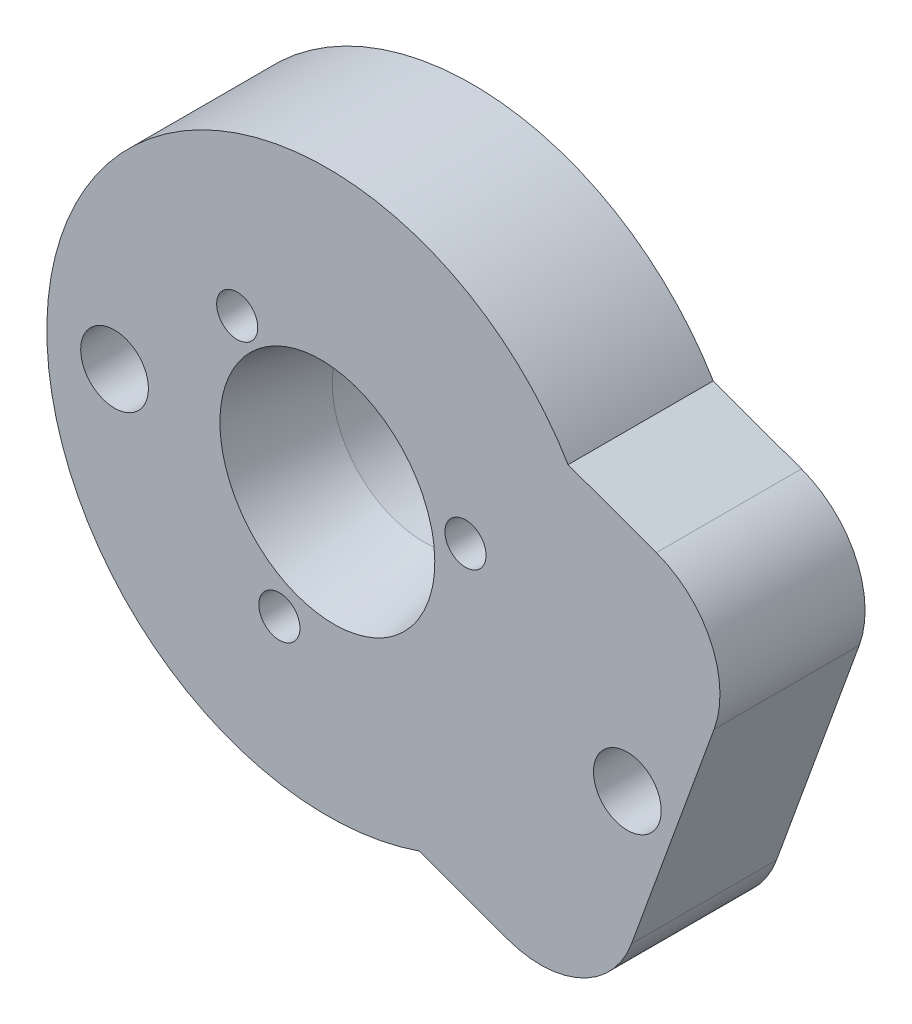
ISO-10303-21;
HEADER;
FILE_DESCRIPTION(('STEP AP214'),'2;1');
FILE_NAME('part.step','',(''),(''),'','','');
FILE_SCHEMA(('AUTOMOTIVE_DESIGN { 1 0 10303 214 1 1 1 1 }'));
ENDSEC;
DATA;
#1=APPLICATION_CONTEXT('core data for automotive mechanical design processes');
#2=APPLICATION_PROTOCOL_DEFINITION('international standard','automotive_design',2000,#1);
#3=PRODUCT_CONTEXT('',#1,'mechanical');
#4=PRODUCT('Part','Part','',(#3));
#5=PRODUCT_RELATED_PRODUCT_CATEGORY('part','',(#4));
#6=PRODUCT_DEFINITION_FORMATION('','',#4);
#7=PRODUCT_DEFINITION_CONTEXT('part definition',#1,'design');
#8=PRODUCT_DEFINITION('design','',#6,#7);
#9=PRODUCT_DEFINITION_SHAPE('','',#8);
#10=(LENGTH_UNIT() NAMED_UNIT(*) SI_UNIT(.MILLI.,.METRE.));
#11=(NAMED_UNIT(*) PLANE_ANGLE_UNIT() SI_UNIT($,.RADIAN.));
#12=(NAMED_UNIT(*) SI_UNIT($,.STERADIAN.) SOLID_ANGLE_UNIT());
#13=UNCERTAINTY_MEASURE_WITH_UNIT(LENGTH_MEASURE(1.E-05),#10,'distance_accuracy_value','');
#14=(GEOMETRIC_REPRESENTATION_CONTEXT(3) GLOBAL_UNCERTAINTY_ASSIGNED_CONTEXT((#13)) GLOBAL_UNIT_ASSIGNED_CONTEXT((#10,
#11,#12)) REPRESENTATION_CONTEXT('',''));
#15=CARTESIAN_POINT('',(0.,0.,0.));
#16=DIRECTION('',(0.,0.,1.));
#17=DIRECTION('',(1.,0.,0.));
#18=AXIS2_PLACEMENT_3D('',#15,#16,#17);
#19=CARTESIAN_POINT('',(0.,0.,10.));
#20=DIRECTION('',(0.,0.,-1.));
#21=DIRECTION('',(-1.,0.,0.));
#22=AXIS2_PLACEMENT_3D('',#19,#20,#21);
#23=CYLINDRICAL_SURFACE('',#22,29.);
#24=CARTESIAN_POINT('',(0.,0.,-5.));
#25=DIRECTION('',(0.,0.,1.));
#26=DIRECTION('',(1.,0.,0.));
#27=AXIS2_PLACEMENT_3D('',#24,#25,#26);
#28=CIRCLE('',#27,29.);
#29=CARTESIAN_POINT('',(24.88823335682,14.8854237553544,-5.));
#30=VERTEX_POINT('',#29);
#31=CARTESIAN_POINT('',(9.49732690716521,-27.4007441800115,-5.));
#32=VERTEX_POINT('',#31);
#33=EDGE_CURVE('E272',#30,#32,#28,.T.);
#34=ORIENTED_EDGE('',*,*,#33,.T.);
#35=DIRECTION('',(0.,0.,-1.));
#36=VECTOR('',#35,1.);
#37=CARTESIAN_POINT('',(9.4973269071652,-27.4007441800115,10.));
#38=LINE('',#37,#36);
#39=CARTESIAN_POINT('',(9.49732690716521,-27.4007441800115,10.));
#40=VERTEX_POINT('',#39);
#41=EDGE_CURVE('E164',#32,#40,#38,.F.);
#42=ORIENTED_EDGE('',*,*,#41,.T.);
#43=CARTESIAN_POINT('',(0.,0.,10.));
#44=DIRECTION('',(0.,0.,1.));
#45=DIRECTION('',(1.,0.,0.));
#46=AXIS2_PLACEMENT_3D('',#43,#44,#45);
#47=CIRCLE('',#46,29.);
#48=CARTESIAN_POINT('',(24.88823335682,14.8854237553544,10.));
#49=VERTEX_POINT('',#48);
#50=EDGE_CURVE('E13',#49,#40,#47,.T.);
#51=ORIENTED_EDGE('',*,*,#50,.F.);
#52=DIRECTION('',(0.,0.,-1.));
#53=VECTOR('',#52,1.);
#54=CARTESIAN_POINT('',(24.88823335682,14.8854237553544,10.));
#55=LINE('',#54,#53);
#56=EDGE_CURVE('E239',#30,#49,#55,.F.);
#57=ORIENTED_EDGE('',*,*,#56,.F.);
#58=EDGE_LOOP('',(#34,#42,#51,#57));
#59=FACE_BOUND('',#58,.T.);
#60=ADVANCED_FACE('F140',(#59),#23,.T.);
#61=CARTESIAN_POINT('',(0.,0.,10.));
#62=DIRECTION('',(0.,0.,1.));
#63=DIRECTION('',(1.,0.,0.));
#64=AXIS2_PLACEMENT_3D('',#61,#62,#63);
#65=PLANE('',#64);
#66=CARTESIAN_POINT('',(-22.,0.,10.));
#67=DIRECTION('',(0.,0.,1.));
#68=DIRECTION('',(1.,0.,0.));
#69=AXIS2_PLACEMENT_3D('',#66,#67,#68);
#70=CIRCLE('',#69,3.5);
#71=CARTESIAN_POINT('',(-18.5,0.,10.));
#72=VERTEX_POINT('',#71);
#73=EDGE_CURVE('E224',#72,#72,#70,.T.);
#74=ORIENTED_EDGE('',*,*,#73,.F.);
#75=EDGE_LOOP('',(#74));
#76=FACE_BOUND('',#75,.T.);
#77=ORIENTED_EDGE('',*,*,#50,.T.);
#78=DIRECTION('',(-0.939692620785911,0.342020143325662,0.));
#79=VECTOR('',#78,1.);
#80=CARTESIAN_POINT('',(18.6159401571781,-30.7196479808015,10.));
#81=LINE('',#80,#79);
#82=CARTESIAN_POINT('',(18.6159401571781,-30.7196479808015,10.));
#83=VERTEX_POINT('',#82);
#84=EDGE_CURVE('E240',#83,#40,#81,.T.);
#85=ORIENTED_EDGE('',*,*,#84,.F.);
#86=CARTESIAN_POINT('',(22.0361415904347,-21.3227217729424,10.));
#87=DIRECTION('',(0.,0.,1.));
#88=DIRECTION('',(1.,0.,0.));
#89=AXIS2_PLACEMENT_3D('',#86,#87,#88);
#90=CIRCLE('',#89,9.99999999999999);
#91=CARTESIAN_POINT('',(31.4330677982938,-24.7429232061991,10.));
#92=VERTEX_POINT('',#91);
#93=EDGE_CURVE('E202',#92,#83,#90,.F.);
#94=ORIENTED_EDGE('',*,*,#93,.F.);
#95=DIRECTION('',(0.342020143325663,0.93969262078591,0.));
#96=VECTOR('',#95,1.);
#97=CARTESIAN_POINT('',(31.4330677982938,-24.7429232061991,10.));
#98=LINE('',#97,#96);
#99=CARTESIAN_POINT('',(39.9835713814354,-1.25060768655132,10.));
#100=VERTEX_POINT('',#99);
#101=EDGE_CURVE('E218',#92,#100,#98,.T.);
#102=ORIENTED_EDGE('',*,*,#101,.T.);
#103=CARTESIAN_POINT('',(30.5866451735763,2.16959374670531,10.));
#104=DIRECTION('',(0.,0.,1.));
#105=DIRECTION('',(1.,0.,0.));
#106=AXIS2_PLACEMENT_3D('',#103,#104,#105);
#107=CIRCLE('',#106,10.);
#108=CARTESIAN_POINT('',(34.0068466068329,11.5665199545644,10.));
#109=VERTEX_POINT('',#108);
#110=EDGE_CURVE('E220',#100,#109,#107,.T.);
#111=ORIENTED_EDGE('',*,*,#110,.T.);
#112=DIRECTION('',(-0.93969262078591,0.342020143325664,0.));
#113=VECTOR('',#112,1.);
#114=CARTESIAN_POINT('',(34.0068466068329,11.5665199545644,10.));
#115=LINE('',#114,#113);
#116=EDGE_CURVE('E156',#109,#49,#115,.T.);
#117=ORIENTED_EDGE('',*,*,#116,.T.);
#118=EDGE_LOOP('',(#77,#85,#94,#102,#111,#117));
#119=FACE_BOUND('',#118,.T.);
#120=CARTESIAN_POINT('',(0.,0.,10.));
#121=DIRECTION('',(0.,0.,1.));
#122=DIRECTION('',(0.500000000000004,-0.866025403784436,0.));
#123=AXIS2_PLACEMENT_3D('',#120,#121,#122);
#124=ELLIPSE('',#123,11.7,10.9);
#125=CARTESIAN_POINT('',(5.85000000000005,-10.1324972242779,10.));
#126=VERTEX_POINT('',#125);
#127=EDGE_CURVE('E149',#126,#126,#124,.T.);
#128=ORIENTED_EDGE('',*,*,#127,.F.);
#129=EDGE_LOOP('',(#128));
#130=FACE_BOUND('',#129,.T.);
#131=CARTESIAN_POINT('',(-4.95929207822124,-13.6255430013952,10.));
#132=DIRECTION('',(0.,0.,1.));
#133=DIRECTION('',(1.,0.,0.));
#134=AXIS2_PLACEMENT_3D('',#131,#132,#133);
#135=CIRCLE('',#134,2.125);
#136=CARTESIAN_POINT('',(-2.83429207822124,-13.6255430013952,10.));
#137=VERTEX_POINT('',#136);
#138=EDGE_CURVE('E254',#137,#137,#135,.T.);
#139=ORIENTED_EDGE('',*,*,#138,.F.);
#140=EDGE_LOOP('',(#139));
#141=FACE_BOUND('',#140,.T.);
#142=CARTESIAN_POINT('',(14.279712418677,2.51789857617159,10.));
#143=DIRECTION('',(0.,0.,1.));
#144=DIRECTION('',(1.,0.,0.));
#145=AXIS2_PLACEMENT_3D('',#142,#143,#144);
#146=CIRCLE('',#145,2.125);
#147=CARTESIAN_POINT('',(16.404712418677,2.51789857617159,10.));
#148=VERTEX_POINT('',#147);
#149=EDGE_CURVE('E262',#148,#148,#146,.T.);
#150=ORIENTED_EDGE('',*,*,#149,.F.);
#151=EDGE_LOOP('',(#150));
#152=FACE_BOUND('',#151,.T.);
#153=CARTESIAN_POINT('',(-9.32042034045485,11.1076444252252,10.));
#154=DIRECTION('',(0.,0.,1.));
#155=DIRECTION('',(1.,0.,0.));
#156=AXIS2_PLACEMENT_3D('',#153,#154,#155);
#157=CIRCLE('',#156,2.125);
#158=CARTESIAN_POINT('',(-7.19542034045485,11.1076444252252,10.));
#159=VERTEX_POINT('',#158);
#160=EDGE_CURVE('E265',#159,#159,#157,.T.);
#161=ORIENTED_EDGE('',*,*,#160,.F.);
#162=EDGE_LOOP('',(#161));
#163=FACE_BOUND('',#162,.T.);
#164=CARTESIAN_POINT('',(31.009856485935,-11.2866647297469,10.));
#165=DIRECTION('',(0.,0.,1.));
#166=DIRECTION('',(1.,0.,0.));
#167=AXIS2_PLACEMENT_3D('',#164,#165,#166);
#168=CIRCLE('',#167,3.5);
#169=CARTESIAN_POINT('',(34.509856485935,-11.2866647297469,10.));
#170=VERTEX_POINT('',#169);
#171=EDGE_CURVE('E236',#170,#170,#168,.F.);
#172=ORIENTED_EDGE('',*,*,#171,.T.);
#173=EDGE_LOOP('',(#172));
#174=FACE_BOUND('',#173,.T.);
#175=ADVANCED_FACE('F313',(#76,#119,#130,#141,#152,#163,#174),#65,.T.);
#176=CARTESIAN_POINT('',(-8.2272413359522,-4.74999999999995,0.));
#177=CARTESIAN_POINT('',(-8.42931393016856,-4.86666666666662,1.66666666666667));
#178=CARTESIAN_POINT('',(-8.83345911860129,-5.09999999999996,5.));
#179=CARTESIAN_POINT('',(-9.237604307034,-5.33333333333335,8.33333333333333));
#180=CARTESIAN_POINT('',(-9.43967690125036,-5.45000000000005,10.));
#181=CARTESIAN_POINT('',(-7.60546779489093,-5.8269433639201,0.));
#182=CARTESIAN_POINT('',(-7.78706689015017,-5.97907117098922,1.66666666666667));
#183=CARTESIAN_POINT('',(-8.15026508066864,-6.28332678512747,5.));
#184=CARTESIAN_POINT('',(-8.51666298543088,-6.58204033162581,8.33333333333333));
#185=CARTESIAN_POINT('',(-8.699861937812,-6.73139710487497,10.));
#186=CARTESIAN_POINT('',(-5.93428765157635,-7.73339621782849,0.));
#187=CARTESIAN_POINT('',(-6.07184627964156,-7.95489124411117,1.66666666666666));
#188=CARTESIAN_POINT('',(-6.34696353577197,-8.39788129667655,5.));
#189=CARTESIAN_POINT('',(-6.62560368094945,-8.82043661085555,8.33333333333334));
#190=CARTESIAN_POINT('',(-6.76492375353818,-9.03171426794505,10.));
#191=CARTESIAN_POINT('',(-2.52271263730693,-9.41546349724764,0.));
#192=CARTESIAN_POINT('',(-2.57075740713248,-9.73346941615548,1.66666666666667));
#193=CARTESIAN_POINT('',(-2.66684694678358,-10.3694812539712,5.00000000000001));
#194=CARTESIAN_POINT('',(-2.77030559858351,-10.9465261862933,8.33333333333333));
#195=CARTESIAN_POINT('',(-2.82203492448348,-11.2350486524544,9.99999999999999));
#196=CARTESIAN_POINT('',(1.27227334912264,-9.66428554733693,0.));
#197=CARTESIAN_POINT('',(1.34693140463563,-10.0387457867895,1.66666666666666));
#198=CARTESIAN_POINT('',(1.49624751566162,-10.7876662656946,5.));
#199=CARTESIAN_POINT('',(1.61681931529875,-11.4482412450606,8.33333333333333));
#200=CARTESIAN_POINT('',(1.67710521511731,-11.7785287347436,9.99999999999999));
#201=CARTESIAN_POINT('',(4.8738319958937,-8.44172464444286,0.));
#202=CARTESIAN_POINT('',(5.07724941175743,-8.79405394386322,1.66666666666667));
#203=CARTESIAN_POINT('',(5.48408424348489,-9.49871254270392,5.00000000000002));
#204=CARTESIAN_POINT('',(5.83864101663948,-10.1128228879752,8.33333333333335));
#205=CARTESIAN_POINT('',(6.01591940321678,-10.4198780606109,10.));
#206=CARTESIAN_POINT('',(7.73338011885922,-5.93396381456668,0.));
#207=CARTESIAN_POINT('',(8.02034317117585,-6.18584970696435,1.66666666666666));
#208=CARTESIAN_POINT('',(8.59426927580909,-6.68962149175969,4.99999999999998));
#209=CARTESIAN_POINT('',(9.10605808922591,-7.12432722290843,8.33333333333333));
#210=CARTESIAN_POINT('',(9.36195249593433,-7.34168008848279,10.));
#211=CARTESIAN_POINT('',(9.41538689567493,-2.52299851826811,0.));
#212=CARTESIAN_POINT('',(9.71481048491571,-2.64039348653412,1.66666666666667));
#213=CARTESIAN_POINT('',(10.3136576633973,-2.87518342306615,5.00000000000003));
#214=CARTESIAN_POINT('',(10.8651225598133,-3.07410806852712,8.33333333333334));
#215=CARTESIAN_POINT('',(11.1408550080214,-3.17357039125761,10.));
#216=CARTESIAN_POINT('',(9.66446140795818,1.27254575071504,0.));
#217=CARTESIAN_POINT('',(9.92506104156348,1.28092750398791,1.66666666666666));
#218=CARTESIAN_POINT('',(10.4462603087741,1.29769101053365,4.99999999999998));
#219=CARTESIAN_POINT('',(10.951524017946,1.32772279768209,8.33333333333333));
#220=CARTESIAN_POINT('',(11.2041558725319,1.34273869125631,10.));
#221=CARTESIAN_POINT('',(8.84901487701347,3.6730566360798,0.));
#222=CARTESIAN_POINT('',(9.07156097018697,3.75426216234402,1.66666666666667));
#223=CARTESIAN_POINT('',(9.51665315653395,3.91667321487245,5.));
#224=CARTESIAN_POINT('',(9.95854562863716,4.08462633504082,8.33333333333333));
#225=CARTESIAN_POINT('',(10.1794918646888,4.16860289512501,10.));
#226=CARTESIAN_POINT('',(7.60546779489093,5.8269433639201,0.));
#227=CARTESIAN_POINT('',(7.78706689015017,5.97907117098922,1.66666666666667));
#228=CARTESIAN_POINT('',(8.15026508066865,6.28332678512746,5.));
#229=CARTESIAN_POINT('',(8.51666298543093,6.58204033162574,8.33333333333333));
#230=CARTESIAN_POINT('',(8.69986193781207,6.73139710487488,10.));
#231=CARTESIAN_POINT('',(5.93428765157634,7.73339621782852,0.));
#232=CARTESIAN_POINT('',(6.07184627964155,7.95489124411119,1.66666666666667));
#233=CARTESIAN_POINT('',(6.34696353577197,8.39788129667652,5.));
#234=CARTESIAN_POINT('',(6.62560368094951,8.82043661085551,8.33333333333334));
#235=CARTESIAN_POINT('',(6.76492375353827,9.031714267945,10.));
#236=CARTESIAN_POINT('',(2.52271263730692,9.41546349724761,0.));
#237=CARTESIAN_POINT('',(2.57075740713246,9.73346941615547,1.66666666666667));
#238=CARTESIAN_POINT('',(2.66684694678356,10.3694812539712,5.00000000000001));
#239=CARTESIAN_POINT('',(2.77030559858355,10.9465261862933,8.33333333333332));
#240=CARTESIAN_POINT('',(2.82203492448355,11.2350486524544,9.99999999999998));
#241=CARTESIAN_POINT('',(-1.27227334912264,9.66428554733697,0.));
#242=CARTESIAN_POINT('',(-1.34693140463563,10.0387457867895,1.66666666666666));
#243=CARTESIAN_POINT('',(-1.49624751566162,10.7876662656946,4.99999999999999));
#244=CARTESIAN_POINT('',(-1.61681931529871,11.4482412450606,8.33333333333335));
#245=CARTESIAN_POINT('',(-1.67710521511726,11.7785287347437,10.));
#246=CARTESIAN_POINT('',(-4.87383199589369,8.44172464444285,0.));
#247=CARTESIAN_POINT('',(-5.07724941175744,8.7940539438632,1.66666666666667));
#248=CARTESIAN_POINT('',(-5.48408424348494,9.49871254270392,5.00000000000002));
#249=CARTESIAN_POINT('',(-5.83864101663949,10.1128228879752,8.33333333333332));
#250=CARTESIAN_POINT('',(-6.01591940321676,10.4198780606109,9.99999999999997));
#251=CARTESIAN_POINT('',(-7.73338011885922,5.9339638145667,0.));
#252=CARTESIAN_POINT('',(-8.02034317117583,6.18584970696437,1.66666666666666));
#253=CARTESIAN_POINT('',(-8.59426927580905,6.6896214917597,4.99999999999999));
#254=CARTESIAN_POINT('',(-9.10605808922591,7.12432722290842,8.33333333333336));
#255=CARTESIAN_POINT('',(-9.36195249593434,7.34168008848277,10.));
#256=CARTESIAN_POINT('',(-9.41538689567493,2.52299851826811,0.));
#257=CARTESIAN_POINT('',(-9.71481048491571,2.64039348653411,1.66666666666666));
#258=CARTESIAN_POINT('',(-10.3136576633973,2.87518342306611,4.99999999999999));
#259=CARTESIAN_POINT('',(-10.8651225598134,3.07410806852708,8.3333333333333));
#260=CARTESIAN_POINT('',(-11.1408550080214,3.17357039125757,9.99999999999996));
#261=CARTESIAN_POINT('',(-9.66446140795817,-1.27254575071502,0.));
#262=CARTESIAN_POINT('',(-9.92506104156348,-1.28092750398789,1.66666666666667));
#263=CARTESIAN_POINT('',(-10.4462603087741,-1.29769101053363,5.00000000000001));
#264=CARTESIAN_POINT('',(-10.951524017946,-1.32772279768215,8.33333333333336));
#265=CARTESIAN_POINT('',(-11.2041558725319,-1.34273869125641,10.));
#266=CARTESIAN_POINT('',(-8.84901487701347,-3.6730566360798,0.));
#267=CARTESIAN_POINT('',(-9.07156097018697,-3.75426216234402,1.66666666666667));
#268=CARTESIAN_POINT('',(-9.51665315653394,-3.91667321487246,5.));
#269=CARTESIAN_POINT('',(-9.95854562863712,-4.08462633504089,8.33333333333333));
#270=CARTESIAN_POINT('',(-10.1794918646887,-4.16860289512511,10.));
#271=CARTESIAN_POINT('',(-8.2272413359522,-4.74999999999995,0.));
#272=CARTESIAN_POINT('',(-8.42931393016856,-4.86666666666662,1.66666666666667));
#273=CARTESIAN_POINT('',(-8.83345911860129,-5.09999999999996,5.));
#274=CARTESIAN_POINT('',(-9.237604307034,-5.33333333333335,8.33333333333333));
#275=CARTESIAN_POINT('',(-9.43967690125036,-5.45000000000005,10.));
#276=B_SPLINE_SURFACE_WITH_KNOTS('',3,3,((#176,#177,#178,#179,#180),(#181,#182,#183,#184,#185),
(#186,#187,#188,#189,#190),(#191,#192,#193,#194,#195),(#196,#197,#198,#199,#200),(#201,#202,
#203,#204,#205),(#206,#207,#208,#209,#210),(#211,#212,#213,#214,#215),(#216,#217,#218,#219,
#220),(#221,#222,#223,#224,#225),(#226,#227,#228,#229,#230),(#231,#232,#233,#234,#235),(#236,
#237,#238,#239,#240),(#241,#242,#243,#244,#245),(#246,#247,#248,#249,#250),(#251,#252,#253,#254,
#255),(#256,#257,#258,#259,#260),(#261,#262,#263,#264,#265),(#266,#267,#268,#269,#270),(#271,
#272,#273,#274,#275)),.UNSPECIFIED.,.T.,.F.,.F.,(4,1,1,1,1,1,1,1,2,1,1,1,1,1,1,1,4),(4,1,4),(0.,
0.0624999999999999,0.125,0.1875,0.25,0.3125,0.375,0.437499999999999,0.499999999999999,
0.562499999999999,0.624999999999999,0.6875,0.75,0.8125,0.875,0.9375,1.),(0.,0.5,1.),.UNSPECIFIED.);
#277=CARTESIAN_POINT('',(0.,0.,0.));
#278=DIRECTION('',(0.,0.,1.));
#279=DIRECTION('',(0.500000000000004,-0.866025403784436,0.));
#280=AXIS2_PLACEMENT_3D('',#277,#278,#279);
#281=ELLIPSE('',#280,9.50000000000001,9.50000000000001);
#282=CARTESIAN_POINT('',(4.75000000000004,-8.22724133595215,0.));
#283=VERTEX_POINT('',#282);
#284=EDGE_CURVE('E297',#283,#283,#281,.T.);
#285=ORIENTED_EDGE('',*,*,#284,.F.);
#286=EDGE_LOOP('',(#285));
#287=FACE_BOUND('',#286,.T.);
#288=ORIENTED_EDGE('',*,*,#127,.T.);
#289=EDGE_LOOP('',(#288));
#290=FACE_BOUND('',#289,.T.);
#291=ADVANCED_FACE('F303',(#287,#290),#276,.F.);
#292=CARTESIAN_POINT('',(0.,0.,-5.));
#293=DIRECTION('',(0.,0.,1.));
#294=DIRECTION('',(1.,0.,0.));
#295=AXIS2_PLACEMENT_3D('',#292,#293,#294);
#296=PLANE('',#295);
#297=CARTESIAN_POINT('',(-22.,0.,-5.));
#298=DIRECTION('',(0.,0.,-1.));
#299=DIRECTION('',(-1.,0.,0.));
#300=AXIS2_PLACEMENT_3D('',#297,#298,#299);
#301=CIRCLE('',#300,3.5);
#302=CARTESIAN_POINT('',(-25.5,0.,-5.));
#303=VERTEX_POINT('',#302);
#304=EDGE_CURVE('E506',#303,#303,#301,.T.);
#305=ORIENTED_EDGE('',*,*,#304,.F.);
#306=EDGE_LOOP('',(#305));
#307=FACE_BOUND('',#306,.T.);
#308=ORIENTED_EDGE('',*,*,#33,.F.);
#309=DIRECTION('',(-0.93969262078591,0.342020143325664,0.));
#310=VECTOR('',#309,1.);
#311=CARTESIAN_POINT('',(34.0068466068329,11.5665199545644,-5.));
#312=LINE('',#311,#310);
#313=CARTESIAN_POINT('',(34.0068466068329,11.5665199545644,-5.));
#314=VERTEX_POINT('',#313);
#315=EDGE_CURVE('E232',#314,#30,#312,.T.);
#316=ORIENTED_EDGE('',*,*,#315,.F.);
#317=CARTESIAN_POINT('',(30.5866451735763,2.16959374670531,-5.));
#318=DIRECTION('',(0.,0.,1.));
#319=DIRECTION('',(1.,0.,0.));
#320=AXIS2_PLACEMENT_3D('',#317,#318,#319);
#321=CIRCLE('',#320,10.);
#322=CARTESIAN_POINT('',(39.9835713814354,-1.25060768655132,-5.));
#323=VERTEX_POINT('',#322);
#324=EDGE_CURVE('E228',#323,#314,#321,.T.);
#325=ORIENTED_EDGE('',*,*,#324,.F.);
#326=DIRECTION('',(0.342020143325663,0.93969262078591,0.));
#327=VECTOR('',#326,1.);
#328=CARTESIAN_POINT('',(31.4330677982938,-24.7429232061991,-5.));
#329=LINE('',#328,#327);
#330=CARTESIAN_POINT('',(31.4330677982938,-24.7429232061991,-5.));
#331=VERTEX_POINT('',#330);
#332=EDGE_CURVE('E217',#331,#323,#329,.T.);
#333=ORIENTED_EDGE('',*,*,#332,.F.);
#334=CARTESIAN_POINT('',(22.0361415904347,-21.3227217729424,-5.));
#335=DIRECTION('',(0.,0.,-1.));
#336=DIRECTION('',(-1.,0.,0.));
#337=AXIS2_PLACEMENT_3D('',#334,#335,#336);
#338=CIRCLE('',#337,9.99999999999999);
#339=CARTESIAN_POINT('',(18.6159401571781,-30.7196479808015,-5.));
#340=VERTEX_POINT('',#339);
#341=EDGE_CURVE('E201',#331,#340,#338,.T.);
#342=ORIENTED_EDGE('',*,*,#341,.T.);
#343=DIRECTION('',(-0.939692620785911,0.342020143325662,0.));
#344=VECTOR('',#343,1.);
#345=CARTESIAN_POINT('',(18.6159401571781,-30.7196479808015,-5.));
#346=LINE('',#345,#344);
#347=EDGE_CURVE('E205',#340,#32,#346,.T.);
#348=ORIENTED_EDGE('',*,*,#347,.T.);
#349=EDGE_LOOP('',(#308,#316,#325,#333,#342,#348));
#350=FACE_BOUND('',#349,.T.);
#351=CARTESIAN_POINT('',(-9.32042034045485,11.1076444252252,-5.));
#352=DIRECTION('',(0.,0.,1.));
#353=DIRECTION('',(1.,0.,0.));
#354=AXIS2_PLACEMENT_3D('',#351,#352,#353);
#355=CIRCLE('',#354,2.125);
#356=CARTESIAN_POINT('',(-7.19542034045485,11.1076444252252,-5.));
#357=VERTEX_POINT('',#356);
#358=EDGE_CURVE('E251',#357,#357,#355,.T.);
#359=ORIENTED_EDGE('',*,*,#358,.T.);
#360=EDGE_LOOP('',(#359));
#361=FACE_BOUND('',#360,.T.);
#362=CARTESIAN_POINT('',(14.279712418677,2.51789857617159,-5.));
#363=DIRECTION('',(0.,0.,1.));
#364=DIRECTION('',(1.,0.,0.));
#365=AXIS2_PLACEMENT_3D('',#362,#363,#364);
#366=CIRCLE('',#365,2.125);
#367=CARTESIAN_POINT('',(16.404712418677,2.51789857617159,-5.));
#368=VERTEX_POINT('',#367);
#369=EDGE_CURVE('E255',#368,#368,#366,.T.);
#370=ORIENTED_EDGE('',*,*,#369,.T.);
#371=EDGE_LOOP('',(#370));
#372=FACE_BOUND('',#371,.T.);
#373=CARTESIAN_POINT('',(-4.95929207822124,-13.6255430013952,-5.));
#374=DIRECTION('',(0.,0.,1.));
#375=DIRECTION('',(1.,0.,0.));
#376=AXIS2_PLACEMENT_3D('',#373,#374,#375);
#377=CIRCLE('',#376,2.125);
#378=CARTESIAN_POINT('',(-2.83429207822124,-13.6255430013952,-5.));
#379=VERTEX_POINT('',#378);
#380=EDGE_CURVE('E250',#379,#379,#377,.T.);
#381=ORIENTED_EDGE('',*,*,#380,.T.);
#382=EDGE_LOOP('',(#381));
#383=FACE_BOUND('',#382,.T.);
#384=CARTESIAN_POINT('',(0.,0.,-5.));
#385=DIRECTION('',(0.,0.,1.));
#386=DIRECTION('',(0.500000000000004,-0.866025403784436,0.));
#387=AXIS2_PLACEMENT_3D('',#384,#385,#386);
#388=ELLIPSE('',#387,9.50000000000001,9.50000000000001);
#389=CARTESIAN_POINT('',(4.75000000000004,-8.22724133595215,-5.));
#390=VERTEX_POINT('',#389);
#391=EDGE_CURVE('E268',#390,#390,#388,.T.);
#392=ORIENTED_EDGE('',*,*,#391,.T.);
#393=EDGE_LOOP('',(#392));
#394=FACE_BOUND('',#393,.T.);
#395=CARTESIAN_POINT('',(31.009856485935,-11.2866647297469,-5.));
#396=DIRECTION('',(0.,0.,-1.));
#397=DIRECTION('',(-1.,0.,0.));
#398=AXIS2_PLACEMENT_3D('',#395,#396,#397);
#399=CIRCLE('',#398,3.5);
#400=CARTESIAN_POINT('',(27.509856485935,-11.2866647297469,-5.));
#401=VERTEX_POINT('',#400);
#402=EDGE_CURVE('E210',#401,#401,#399,.T.);
#403=ORIENTED_EDGE('',*,*,#402,.F.);
#404=EDGE_LOOP('',(#403));
#405=FACE_BOUND('',#404,.T.);
#406=ADVANCED_FACE('F213',(#307,#350,#361,#372,#383,#394,#405),#296,.F.);
#407=DIRECTION('',(0.,0.,1.));
#408=VECTOR('',#407,1.);
#409=SURFACE_OF_LINEAR_EXTRUSION('',#388,#408);
#410=ORIENTED_EDGE('',*,*,#391,.F.);
#411=EDGE_LOOP('',(#410));
#412=FACE_BOUND('',#411,.T.);
#413=ORIENTED_EDGE('',*,*,#284,.T.);
#414=EDGE_LOOP('',(#413));
#415=FACE_BOUND('',#414,.T.);
#416=ADVANCED_FACE('F275',(#412,#415),#409,.F.);
#417=CARTESIAN_POINT('',(-4.95929207822124,-13.6255430013952,-5.));
#418=DIRECTION('',(0.,0.,1.));
#419=DIRECTION('',(1.,0.,0.));
#420=AXIS2_PLACEMENT_3D('',#417,#418,#419);
#421=CYLINDRICAL_SURFACE('',#420,2.125);
#422=ORIENTED_EDGE('',*,*,#138,.T.);
#423=EDGE_LOOP('',(#422));
#424=FACE_BOUND('',#423,.T.);
#425=ORIENTED_EDGE('',*,*,#380,.F.);
#426=EDGE_LOOP('',(#425));
#427=FACE_BOUND('',#426,.T.);
#428=ADVANCED_FACE('F280',(#424,#427),#421,.F.);
#429=CARTESIAN_POINT('',(14.279712418677,2.51789857617159,-5.));
#430=DIRECTION('',(0.,0.,1.));
#431=DIRECTION('',(1.,0.,0.));
#432=AXIS2_PLACEMENT_3D('',#429,#430,#431);
#433=CYLINDRICAL_SURFACE('',#432,2.125);
#434=ORIENTED_EDGE('',*,*,#149,.T.);
#435=EDGE_LOOP('',(#434));
#436=FACE_BOUND('',#435,.T.);
#437=ORIENTED_EDGE('',*,*,#369,.F.);
#438=EDGE_LOOP('',(#437));
#439=FACE_BOUND('',#438,.T.);
#440=ADVANCED_FACE('F392',(#436,#439),#433,.F.);
#441=CARTESIAN_POINT('',(-9.32042034045485,11.1076444252252,-5.));
#442=DIRECTION('',(0.,0.,1.));
#443=DIRECTION('',(1.,0.,0.));
#444=AXIS2_PLACEMENT_3D('',#441,#442,#443);
#445=CYLINDRICAL_SURFACE('',#444,2.125);
#446=ORIENTED_EDGE('',*,*,#160,.T.);
#447=EDGE_LOOP('',(#446));
#448=FACE_BOUND('',#447,.T.);
#449=ORIENTED_EDGE('',*,*,#358,.F.);
#450=EDGE_LOOP('',(#449));
#451=FACE_BOUND('',#450,.T.);
#452=ADVANCED_FACE('F387',(#448,#451),#445,.F.);
#453=CARTESIAN_POINT('',(18.6159401571781,-30.7196479808015,65.7566570572385));
#454=DIRECTION('',(-0.342020143325662,-0.939692620785911,0.));
#455=DIRECTION('',(0.939692620785911,-0.342020143325662,0.));
#456=AXIS2_PLACEMENT_3D('',#453,#454,#455);
#457=PLANE('',#456);
#458=ORIENTED_EDGE('',*,*,#41,.F.);
#459=ORIENTED_EDGE('',*,*,#347,.F.);
#460=DIRECTION('',(0.,0.,-1.));
#461=VECTOR('',#460,1.);
#462=CARTESIAN_POINT('',(18.6159401571781,-30.7196479808015,65.7566570572385));
#463=LINE('',#462,#461);
#464=EDGE_CURVE('E197',#83,#340,#463,.T.);
#465=ORIENTED_EDGE('',*,*,#464,.F.);
#466=ORIENTED_EDGE('',*,*,#84,.T.);
#467=EDGE_LOOP('',(#458,#459,#465,#466));
#468=FACE_BOUND('',#467,.T.);
#469=ADVANCED_FACE('F206',(#468),#457,.T.);
#470=CARTESIAN_POINT('',(34.0068466068329,11.5665199545644,65.7566570572385));
#471=DIRECTION('',(-0.342020143325664,-0.93969262078591,0.));
#472=DIRECTION('',(0.93969262078591,-0.342020143325664,0.));
#473=AXIS2_PLACEMENT_3D('',#470,#471,#472);
#474=PLANE('',#473);
#475=ORIENTED_EDGE('',*,*,#315,.T.);
#476=ORIENTED_EDGE('',*,*,#56,.T.);
#477=ORIENTED_EDGE('',*,*,#116,.F.);
#478=DIRECTION('',(0.,0.,-1.));
#479=VECTOR('',#478,1.);
#480=CARTESIAN_POINT('',(34.0068466068329,11.5665199545644,65.7566570572385));
#481=LINE('',#480,#479);
#482=EDGE_CURVE('E231',#109,#314,#481,.T.);
#483=ORIENTED_EDGE('',*,*,#482,.T.);
#484=EDGE_LOOP('',(#475,#476,#477,#483));
#485=FACE_BOUND('',#484,.T.);
#486=ADVANCED_FACE('F373',(#485),#474,.F.);
#487=CARTESIAN_POINT('',(22.0361415904347,-21.3227217729424,65.7566570572385));
#488=DIRECTION('',(0.,0.,-1.));
#489=DIRECTION('',(-1.,0.,0.));
#490=AXIS2_PLACEMENT_3D('',#487,#488,#489);
#491=CYLINDRICAL_SURFACE('',#490,9.99999999999999);
#492=DIRECTION('',(0.,0.,-1.));
#493=VECTOR('',#492,1.);
#494=CARTESIAN_POINT('',(31.4330677982938,-24.7429232061991,65.7566570572385));
#495=LINE('',#494,#493);
#496=EDGE_CURVE('E203',#92,#331,#495,.T.);
#497=ORIENTED_EDGE('',*,*,#496,.F.);
#498=ORIENTED_EDGE('',*,*,#93,.T.);
#499=ORIENTED_EDGE('',*,*,#464,.T.);
#500=ORIENTED_EDGE('',*,*,#341,.F.);
#501=EDGE_LOOP('',(#497,#498,#499,#500));
#502=FACE_BOUND('',#501,.T.);
#503=ADVANCED_FACE('F199',(#502),#491,.T.);
#504=CARTESIAN_POINT('',(31.4330677982938,-24.7429232061991,65.7566570572385));
#505=DIRECTION('',(-0.93969262078591,0.342020143325663,0.));
#506=DIRECTION('',(-0.342020143325663,-0.93969262078591,0.));
#507=AXIS2_PLACEMENT_3D('',#504,#505,#506);
#508=PLANE('',#507);
#509=ORIENTED_EDGE('',*,*,#101,.F.);
#510=ORIENTED_EDGE('',*,*,#496,.T.);
#511=ORIENTED_EDGE('',*,*,#332,.T.);
#512=DIRECTION('',(0.,0.,-1.));
#513=VECTOR('',#512,1.);
#514=CARTESIAN_POINT('',(39.9835713814354,-1.25060768655132,65.7566570572385));
#515=LINE('',#514,#513);
#516=EDGE_CURVE('E227',#100,#323,#515,.T.);
#517=ORIENTED_EDGE('',*,*,#516,.F.);
#518=EDGE_LOOP('',(#509,#510,#511,#517));
#519=FACE_BOUND('',#518,.T.);
#520=ADVANCED_FACE('F360',(#519),#508,.F.);
#521=CARTESIAN_POINT('',(30.5866451735763,2.16959374670531,65.7566570572385));
#522=DIRECTION('',(0.,0.,-1.));
#523=DIRECTION('',(-1.,0.,0.));
#524=AXIS2_PLACEMENT_3D('',#521,#522,#523);
#525=CYLINDRICAL_SURFACE('',#524,10.);
#526=ORIENTED_EDGE('',*,*,#110,.F.);
#527=ORIENTED_EDGE('',*,*,#516,.T.);
#528=ORIENTED_EDGE('',*,*,#324,.T.);
#529=ORIENTED_EDGE('',*,*,#482,.F.);
#530=EDGE_LOOP('',(#526,#527,#528,#529));
#531=FACE_BOUND('',#530,.T.);
#532=ADVANCED_FACE('F351',(#531),#525,.T.);
#533=CARTESIAN_POINT('',(31.009856485935,-11.2866647297469,65.7566570572385));
#534=DIRECTION('',(0.,0.,-1.));
#535=DIRECTION('',(-1.,0.,0.));
#536=AXIS2_PLACEMENT_3D('',#533,#534,#535);
#537=CYLINDRICAL_SURFACE('',#536,3.5);
#538=ORIENTED_EDGE('',*,*,#402,.T.);
#539=EDGE_LOOP('',(#538));
#540=FACE_BOUND('',#539,.T.);
#541=ORIENTED_EDGE('',*,*,#171,.F.);
#542=EDGE_LOOP('',(#541));
#543=FACE_BOUND('',#542,.T.);
#544=ADVANCED_FACE('F348',(#540,#543),#537,.F.);
#545=CARTESIAN_POINT('',(-22.,0.,10.0113971829946));
#546=DIRECTION('',(0.,0.,-1.));
#547=DIRECTION('',(-1.,0.,0.));
#548=AXIS2_PLACEMENT_3D('',#545,#546,#547);
#549=CYLINDRICAL_SURFACE('',#548,3.5);
#550=ORIENTED_EDGE('',*,*,#73,.T.);
#551=EDGE_LOOP('',(#550));
#552=FACE_BOUND('',#551,.T.);
#553=ORIENTED_EDGE('',*,*,#304,.T.);
#554=EDGE_LOOP('',(#553));
#555=FACE_BOUND('',#554,.T.);
#556=ADVANCED_FACE('F350',(#552,#555),#549,.F.);
#557=CLOSED_SHELL('',(#60,#175,#291,#406,#416,#428,#440,#452,#469,#486,#503,#520,#532,#544,#556));
#558=MANIFOLD_SOLID_BREP('B2',#557);
#559=ADVANCED_BREP_SHAPE_REPRESENTATION('',(#18,#558),#14);
#560=SHAPE_DEFINITION_REPRESENTATION(#9,#559);
ENDSEC;
END-ISO-10303-21;
